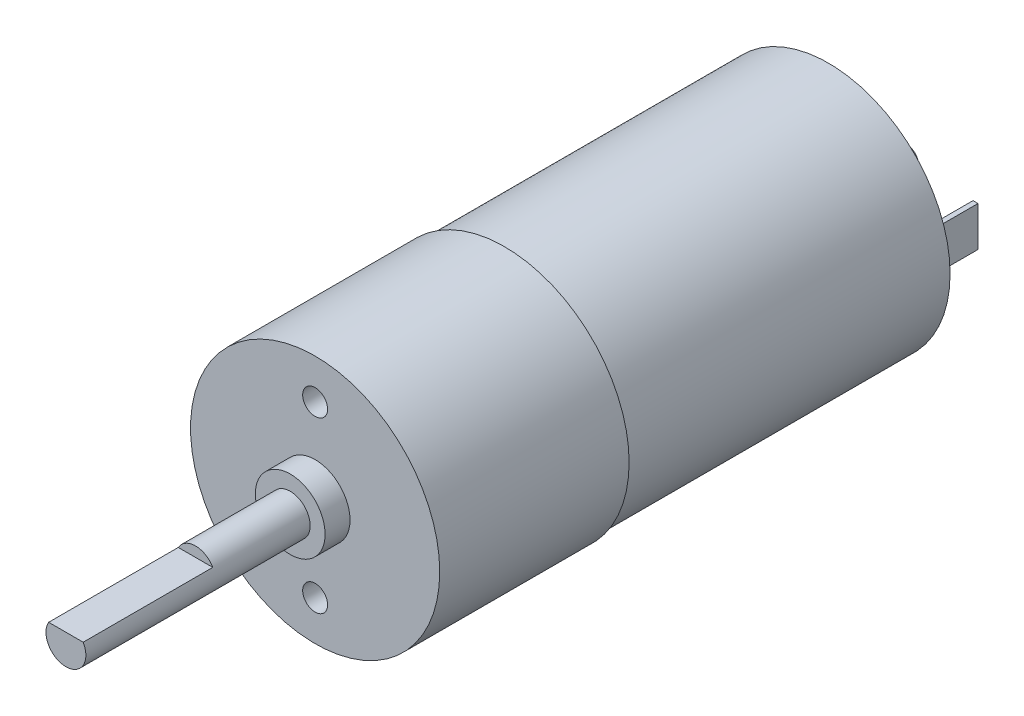
ISO-10303-21;
HEADER;
FILE_DESCRIPTION(('STEP AP214'),'2;1');
FILE_NAME('part.step','',(''),(''),'','','');
FILE_SCHEMA(('AUTOMOTIVE_DESIGN { 1 0 10303 214 1 1 1 1 }'));
ENDSEC;
DATA;
#1=APPLICATION_CONTEXT('core data for automotive mechanical design processes');
#2=APPLICATION_PROTOCOL_DEFINITION('international standard','automotive_design',2000,#1);
#3=PRODUCT_CONTEXT('',#1,'mechanical');
#4=PRODUCT('Part','Part','',(#3));
#5=PRODUCT_RELATED_PRODUCT_CATEGORY('part','',(#4));
#6=PRODUCT_DEFINITION_FORMATION('','',#4);
#7=PRODUCT_DEFINITION_CONTEXT('part definition',#1,'design');
#8=PRODUCT_DEFINITION('design','',#6,#7);
#9=PRODUCT_DEFINITION_SHAPE('','',#8);
#10=(LENGTH_UNIT() NAMED_UNIT(*) SI_UNIT(.MILLI.,.METRE.));
#11=(NAMED_UNIT(*) PLANE_ANGLE_UNIT() SI_UNIT($,.RADIAN.));
#12=(NAMED_UNIT(*) SI_UNIT($,.STERADIAN.) SOLID_ANGLE_UNIT());
#13=UNCERTAINTY_MEASURE_WITH_UNIT(LENGTH_MEASURE(1.E-05),#10,'distance_accuracy_value','');
#14=(GEOMETRIC_REPRESENTATION_CONTEXT(3) GLOBAL_UNCERTAINTY_ASSIGNED_CONTEXT((#13)) GLOBAL_UNIT_ASSIGNED_CONTEXT((#10,
#11,#12)) REPRESENTATION_CONTEXT('',''));
#15=CARTESIAN_POINT('',(0.,0.,0.));
#16=DIRECTION('',(0.,0.,1.));
#17=DIRECTION('',(1.,0.,0.));
#18=AXIS2_PLACEMENT_3D('',#15,#16,#17);
#19=CARTESIAN_POINT('',(0.,0.,-32.5));
#20=DIRECTION('',(0.,0.,-1.));
#21=DIRECTION('',(-1.,0.,0.));
#22=AXIS2_PLACEMENT_3D('',#19,#20,#21);
#23=PLANE('',#22);
#24=DIRECTION('',(1.,0.,0.));
#25=VECTOR('',#24,1.);
#26=CARTESIAN_POINT('',(9.,2.,-32.5));
#27=LINE('',#26,#25);
#28=CARTESIAN_POINT('',(9.,2.,-32.5));
#29=VERTEX_POINT('',#28);
#30=CARTESIAN_POINT('',(9.5,2.,-32.5));
#31=VERTEX_POINT('',#30);
#32=EDGE_CURVE('E139',#29,#31,#27,.T.);
#33=ORIENTED_EDGE('',*,*,#32,.F.);
#34=DIRECTION('',(0.,1.,0.));
#35=VECTOR('',#34,1.);
#36=CARTESIAN_POINT('',(9.,-2.,-32.5));
#37=LINE('',#36,#35);
#38=CARTESIAN_POINT('',(9.,-2.,-32.5));
#39=VERTEX_POINT('',#38);
#40=EDGE_CURVE('E136',#39,#29,#37,.T.);
#41=ORIENTED_EDGE('',*,*,#40,.F.);
#42=DIRECTION('',(-1.,0.,0.));
#43=VECTOR('',#42,1.);
#44=CARTESIAN_POINT('',(9.,-2.,-32.5));
#45=LINE('',#44,#43);
#46=CARTESIAN_POINT('',(9.5,-2.,-32.5));
#47=VERTEX_POINT('',#46);
#48=EDGE_CURVE('E148',#47,#39,#45,.T.);
#49=ORIENTED_EDGE('',*,*,#48,.F.);
#50=DIRECTION('',(0.,-1.,0.));
#51=VECTOR('',#50,1.);
#52=CARTESIAN_POINT('',(9.5,-2.,-32.5));
#53=LINE('',#52,#51);
#54=EDGE_CURVE('E156',#31,#47,#53,.T.);
#55=ORIENTED_EDGE('',*,*,#54,.F.);
#56=EDGE_LOOP('',(#33,#41,#49,#55));
#57=FACE_BOUND('',#56,.T.);
#58=CARTESIAN_POINT('',(0.,0.,-32.5));
#59=DIRECTION('',(0.,0.,-1.));
#60=DIRECTION('',(-1.,0.,0.));
#61=AXIS2_PLACEMENT_3D('',#58,#59,#60);
#62=CIRCLE('',#61,12.2);
#63=CARTESIAN_POINT('',(-12.2,0.,-32.5));
#64=VERTEX_POINT('',#63);
#65=EDGE_CURVE('E189',#64,#64,#62,.T.);
#66=ORIENTED_EDGE('',*,*,#65,.T.);
#67=EDGE_LOOP('',(#66));
#68=FACE_BOUND('',#67,.T.);
#69=CARTESIAN_POINT('',(0.,0.,-32.5));
#70=DIRECTION('',(0.,0.,-1.));
#71=DIRECTION('',(-1.,0.,0.));
#72=AXIS2_PLACEMENT_3D('',#69,#70,#71);
#73=CIRCLE('',#72,3.5);
#74=CARTESIAN_POINT('',(-3.5,0.,-32.5));
#75=VERTEX_POINT('',#74);
#76=EDGE_CURVE('E183',#75,#75,#73,.T.);
#77=ORIENTED_EDGE('',*,*,#76,.F.);
#78=EDGE_LOOP('',(#77));
#79=FACE_BOUND('',#78,.T.);
#80=DIRECTION('',(-1.,0.,0.));
#81=VECTOR('',#80,1.);
#82=CARTESIAN_POINT('',(-9.,-2.,-32.5));
#83=LINE('',#82,#81);
#84=CARTESIAN_POINT('',(-9.,-2.,-32.5));
#85=VERTEX_POINT('',#84);
#86=CARTESIAN_POINT('',(-9.5,-2.,-32.5));
#87=VERTEX_POINT('',#86);
#88=EDGE_CURVE('E532',#85,#87,#83,.T.);
#89=ORIENTED_EDGE('',*,*,#88,.F.);
#90=DIRECTION('',(0.,-1.,0.));
#91=VECTOR('',#90,1.);
#92=CARTESIAN_POINT('',(-9.,-2.,-32.5));
#93=LINE('',#92,#91);
#94=CARTESIAN_POINT('',(-9.,2.,-32.5));
#95=VERTEX_POINT('',#94);
#96=EDGE_CURVE('E134',#95,#85,#93,.T.);
#97=ORIENTED_EDGE('',*,*,#96,.F.);
#98=DIRECTION('',(1.,0.,0.));
#99=VECTOR('',#98,1.);
#100=CARTESIAN_POINT('',(-9.,2.,-32.5));
#101=LINE('',#100,#99);
#102=CARTESIAN_POINT('',(-9.5,2.,-32.5));
#103=VERTEX_POINT('',#102);
#104=EDGE_CURVE('E130',#103,#95,#101,.T.);
#105=ORIENTED_EDGE('',*,*,#104,.F.);
#106=DIRECTION('',(0.,1.,0.));
#107=VECTOR('',#106,1.);
#108=CARTESIAN_POINT('',(-9.5,-2.,-32.5));
#109=LINE('',#108,#107);
#110=EDGE_CURVE('E529',#87,#103,#109,.T.);
#111=ORIENTED_EDGE('',*,*,#110,.F.);
#112=EDGE_LOOP('',(#89,#97,#105,#111));
#113=FACE_BOUND('',#112,.T.);
#114=ADVANCED_FACE('F33',(#57,#68,#79,#113),#23,.T.);
#115=CARTESIAN_POINT('',(0.,0.,-35.5));
#116=DIRECTION('',(0.,0.,-1.));
#117=DIRECTION('',(-1.,0.,0.));
#118=AXIS2_PLACEMENT_3D('',#115,#116,#117);
#119=PLANE('',#118);
#120=CARTESIAN_POINT('',(0.,0.,-35.5));
#121=DIRECTION('',(0.,0.,-1.));
#122=DIRECTION('',(-1.,0.,0.));
#123=AXIS2_PLACEMENT_3D('',#120,#121,#122);
#124=CIRCLE('',#123,3.5);
#125=CARTESIAN_POINT('',(-3.5,0.,-35.5));
#126=VERTEX_POINT('',#125);
#127=EDGE_CURVE('E186',#126,#126,#124,.T.);
#128=ORIENTED_EDGE('',*,*,#127,.T.);
#129=EDGE_LOOP('',(#128));
#130=FACE_BOUND('',#129,.T.);
#131=CARTESIAN_POINT('',(0.,0.,-35.5));
#132=DIRECTION('',(0.,0.,-1.));
#133=DIRECTION('',(-1.,0.,0.));
#134=AXIS2_PLACEMENT_3D('',#131,#132,#133);
#135=CIRCLE('',#134,1.);
#136=CARTESIAN_POINT('',(-1.,0.,-35.5));
#137=VERTEX_POINT('',#136);
#138=EDGE_CURVE('E177',#137,#137,#135,.T.);
#139=ORIENTED_EDGE('',*,*,#138,.F.);
#140=EDGE_LOOP('',(#139));
#141=FACE_BOUND('',#140,.T.);
#142=ADVANCED_FACE('F246',(#130,#141),#119,.T.);
#143=CARTESIAN_POINT('',(0.,0.,0.));
#144=DIRECTION('',(0.,0.,1.));
#145=DIRECTION('',(1.,0.,0.));
#146=AXIS2_PLACEMENT_3D('',#143,#144,#145);
#147=PLANE('',#146);
#148=CARTESIAN_POINT('',(0.,0.,0.));
#149=DIRECTION('',(0.,0.,1.));
#150=DIRECTION('',(1.,0.,0.));
#151=AXIS2_PLACEMENT_3D('',#148,#149,#150);
#152=CIRCLE('',#151,12.5);
#153=CARTESIAN_POINT('',(12.5,0.,0.));
#154=VERTEX_POINT('',#153);
#155=EDGE_CURVE('E213',#154,#154,#152,.T.);
#156=ORIENTED_EDGE('',*,*,#155,.F.);
#157=EDGE_LOOP('',(#156));
#158=FACE_BOUND('',#157,.T.);
#159=CARTESIAN_POINT('',(0.,0.,0.));
#160=DIRECTION('',(0.,0.,1.));
#161=DIRECTION('',(1.,0.,0.));
#162=AXIS2_PLACEMENT_3D('',#159,#160,#161);
#163=CIRCLE('',#162,12.2);
#164=CARTESIAN_POINT('',(12.2,0.,0.));
#165=VERTEX_POINT('',#164);
#166=EDGE_CURVE('E11',#165,#165,#163,.F.);
#167=ORIENTED_EDGE('',*,*,#166,.F.);
#168=EDGE_LOOP('',(#167));
#169=FACE_BOUND('',#168,.T.);
#170=ADVANCED_FACE('F252',(#158,#169),#147,.F.);
#171=CARTESIAN_POINT('',(0.,0.,21.5));
#172=DIRECTION('',(0.,0.,1.));
#173=DIRECTION('',(1.,0.,0.));
#174=AXIS2_PLACEMENT_3D('',#171,#172,#173);
#175=PLANE('',#174);
#176=CARTESIAN_POINT('',(0.,0.,21.5));
#177=DIRECTION('',(0.,0.,1.));
#178=DIRECTION('',(1.,0.,0.));
#179=AXIS2_PLACEMENT_3D('',#176,#177,#178);
#180=CIRCLE('',#179,3.5);
#181=CARTESIAN_POINT('',(3.5,0.,21.5));
#182=VERTEX_POINT('',#181);
#183=EDGE_CURVE('E210',#182,#182,#180,.T.);
#184=ORIENTED_EDGE('',*,*,#183,.T.);
#185=EDGE_LOOP('',(#184));
#186=FACE_BOUND('',#185,.T.);
#187=CARTESIAN_POINT('',(0.,0.,21.5));
#188=DIRECTION('',(0.,0.,1.));
#189=DIRECTION('',(1.,0.,0.));
#190=AXIS2_PLACEMENT_3D('',#187,#188,#189);
#191=CIRCLE('',#190,2.);
#192=CARTESIAN_POINT('',(2.,0.,21.5));
#193=VERTEX_POINT('',#192);
#194=EDGE_CURVE('E203',#193,#193,#191,.T.);
#195=ORIENTED_EDGE('',*,*,#194,.F.);
#196=EDGE_LOOP('',(#195));
#197=FACE_BOUND('',#196,.T.);
#198=ADVANCED_FACE('F451',(#186,#197),#175,.T.);
#199=CARTESIAN_POINT('',(0.,0.,19.));
#200=DIRECTION('',(0.,0.,1.));
#201=DIRECTION('',(1.,0.,0.));
#202=AXIS2_PLACEMENT_3D('',#199,#200,#201);
#203=PLANE('',#202);
#204=CARTESIAN_POINT('',(0.,-8.5,19.));
#205=DIRECTION('',(0.,0.,1.));
#206=DIRECTION('',(1.,0.,0.));
#207=AXIS2_PLACEMENT_3D('',#204,#205,#206);
#208=CIRCLE('',#207,1.25);
#209=CARTESIAN_POINT('',(1.25,-8.5,19.));
#210=VERTEX_POINT('',#209);
#211=EDGE_CURVE('E167',#210,#210,#208,.T.);
#212=ORIENTED_EDGE('',*,*,#211,.F.);
#213=EDGE_LOOP('',(#212));
#214=FACE_BOUND('',#213,.T.);
#215=CARTESIAN_POINT('',(0.,8.5,19.));
#216=DIRECTION('',(0.,0.,1.));
#217=DIRECTION('',(1.,0.,0.));
#218=AXIS2_PLACEMENT_3D('',#215,#216,#217);
#219=CIRCLE('',#218,1.25);
#220=CARTESIAN_POINT('',(1.25,8.5,19.));
#221=VERTEX_POINT('',#220);
#222=EDGE_CURVE('E171',#221,#221,#219,.T.);
#223=ORIENTED_EDGE('',*,*,#222,.F.);
#224=EDGE_LOOP('',(#223));
#225=FACE_BOUND('',#224,.T.);
#226=CARTESIAN_POINT('',(0.,0.,19.));
#227=DIRECTION('',(0.,0.,1.));
#228=DIRECTION('',(1.,0.,0.));
#229=AXIS2_PLACEMENT_3D('',#226,#227,#228);
#230=CIRCLE('',#229,12.5);
#231=CARTESIAN_POINT('',(12.5,0.,19.));
#232=VERTEX_POINT('',#231);
#233=EDGE_CURVE('E216',#232,#232,#230,.T.);
#234=ORIENTED_EDGE('',*,*,#233,.T.);
#235=EDGE_LOOP('',(#234));
#236=FACE_BOUND('',#235,.T.);
#237=CARTESIAN_POINT('',(0.,0.,19.));
#238=DIRECTION('',(0.,0.,1.));
#239=DIRECTION('',(1.,0.,0.));
#240=AXIS2_PLACEMENT_3D('',#237,#238,#239);
#241=CIRCLE('',#240,3.5);
#242=CARTESIAN_POINT('',(3.5,0.,19.));
#243=VERTEX_POINT('',#242);
#244=EDGE_CURVE('E207',#243,#243,#241,.T.);
#245=ORIENTED_EDGE('',*,*,#244,.F.);
#246=EDGE_LOOP('',(#245));
#247=FACE_BOUND('',#246,.T.);
#248=ADVANCED_FACE('F475',(#214,#225,#236,#247),#203,.T.);
#249=CARTESIAN_POINT('',(0.,0.,19.));
#250=DIRECTION('',(0.,0.,-1.));
#251=DIRECTION('',(-1.,0.,0.));
#252=AXIS2_PLACEMENT_3D('',#249,#250,#251);
#253=CYLINDRICAL_SURFACE('',#252,12.5);
#254=ORIENTED_EDGE('',*,*,#233,.F.);
#255=EDGE_LOOP('',(#254));
#256=FACE_BOUND('',#255,.T.);
#257=ORIENTED_EDGE('',*,*,#155,.T.);
#258=EDGE_LOOP('',(#257));
#259=FACE_BOUND('',#258,.T.);
#260=ADVANCED_FACE('F35',(#256,#259),#253,.T.);
#261=CARTESIAN_POINT('',(0.,0.,21.5));
#262=DIRECTION('',(0.,0.,-1.));
#263=DIRECTION('',(-1.,0.,0.));
#264=AXIS2_PLACEMENT_3D('',#261,#262,#263);
#265=CYLINDRICAL_SURFACE('',#264,3.5);
#266=ORIENTED_EDGE('',*,*,#183,.F.);
#267=EDGE_LOOP('',(#266));
#268=FACE_BOUND('',#267,.T.);
#269=ORIENTED_EDGE('',*,*,#244,.T.);
#270=EDGE_LOOP('',(#269));
#271=FACE_BOUND('',#270,.T.);
#272=ADVANCED_FACE('F242',(#268,#271),#265,.T.);
#273=CARTESIAN_POINT('',(0.,0.,44.));
#274=DIRECTION('',(0.,0.,-1.));
#275=DIRECTION('',(-1.,0.,0.));
#276=AXIS2_PLACEMENT_3D('',#273,#274,#275);
#277=CYLINDRICAL_SURFACE('',#276,2.);
#278=CARTESIAN_POINT('',(0.,0.,44.));
#279=DIRECTION('',(0.,0.,1.));
#280=DIRECTION('',(1.,0.,0.));
#281=AXIS2_PLACEMENT_3D('',#278,#279,#280);
#282=CIRCLE('',#281,2.);
#283=CARTESIAN_POINT('',(-1.73205080756888,1.,44.));
#284=VERTEX_POINT('',#283);
#285=CARTESIAN_POINT('',(1.73205080756888,1.,44.));
#286=VERTEX_POINT('',#285);
#287=EDGE_CURVE('E204',#284,#286,#282,.T.);
#288=ORIENTED_EDGE('',*,*,#287,.F.);
#289=DIRECTION('',(0.,0.,-1.));
#290=VECTOR('',#289,1.);
#291=CARTESIAN_POINT('',(-1.73205080756888,1.,44.));
#292=LINE('',#291,#290);
#293=CARTESIAN_POINT('',(-1.73205080756888,1.,31.));
#294=VERTEX_POINT('',#293);
#295=EDGE_CURVE('E200',#284,#294,#292,.T.);
#296=ORIENTED_EDGE('',*,*,#295,.T.);
#297=CARTESIAN_POINT('',(0.,0.,31.));
#298=DIRECTION('',(0.,0.,1.));
#299=DIRECTION('',(1.,0.,0.));
#300=AXIS2_PLACEMENT_3D('',#297,#298,#299);
#301=CIRCLE('',#300,2.);
#302=CARTESIAN_POINT('',(1.73205080756888,1.,31.));
#303=VERTEX_POINT('',#302);
#304=EDGE_CURVE('E41',#303,#294,#301,.T.);
#305=ORIENTED_EDGE('',*,*,#304,.F.);
#306=DIRECTION('',(0.,0.,-1.));
#307=VECTOR('',#306,1.);
#308=CARTESIAN_POINT('',(1.73205080756888,1.,44.));
#309=LINE('',#308,#307);
#310=EDGE_CURVE('E197',#303,#286,#309,.F.);
#311=ORIENTED_EDGE('',*,*,#310,.T.);
#312=EDGE_LOOP('',(#288,#296,#305,#311));
#313=FACE_BOUND('',#312,.T.);
#314=ORIENTED_EDGE('',*,*,#194,.T.);
#315=EDGE_LOOP('',(#314));
#316=FACE_BOUND('',#315,.T.);
#317=ADVANCED_FACE('F231',(#313,#316),#277,.T.);
#318=CARTESIAN_POINT('',(0.,0.,44.));
#319=DIRECTION('',(0.,0.,1.));
#320=DIRECTION('',(1.,0.,0.));
#321=AXIS2_PLACEMENT_3D('',#318,#319,#320);
#322=PLANE('',#321);
#323=DIRECTION('',(1.,0.,0.));
#324=VECTOR('',#323,1.);
#325=CARTESIAN_POINT('',(0.,1.,44.));
#326=LINE('',#325,#324);
#327=EDGE_CURVE('E219',#284,#286,#326,.T.);
#328=ORIENTED_EDGE('',*,*,#327,.F.);
#329=ORIENTED_EDGE('',*,*,#287,.T.);
#330=EDGE_LOOP('',(#328,#329));
#331=FACE_BOUND('',#330,.T.);
#332=ADVANCED_FACE('F234',(#331),#322,.T.);
#333=CARTESIAN_POINT('',(0.,0.,31.));
#334=DIRECTION('',(0.,0.,1.));
#335=DIRECTION('',(1.,0.,0.));
#336=AXIS2_PLACEMENT_3D('',#333,#334,#335);
#337=PLANE('',#336);
#338=ORIENTED_EDGE('',*,*,#304,.T.);
#339=DIRECTION('',(1.,0.,0.));
#340=VECTOR('',#339,1.);
#341=CARTESIAN_POINT('',(3.32973487593335,1.,31.));
#342=LINE('',#341,#340);
#343=EDGE_CURVE('E194',#294,#303,#342,.T.);
#344=ORIENTED_EDGE('',*,*,#343,.T.);
#345=EDGE_LOOP('',(#338,#344));
#346=FACE_BOUND('',#345,.T.);
#347=ADVANCED_FACE('F225',(#346),#337,.T.);
#348=CARTESIAN_POINT('',(3.32973487593335,1.,31.));
#349=DIRECTION('',(0.,-1.,0.));
#350=DIRECTION('',(0.,0.,-1.));
#351=AXIS2_PLACEMENT_3D('',#348,#349,#350);
#352=PLANE('',#351);
#353=ORIENTED_EDGE('',*,*,#327,.T.);
#354=ORIENTED_EDGE('',*,*,#310,.F.);
#355=ORIENTED_EDGE('',*,*,#343,.F.);
#356=ORIENTED_EDGE('',*,*,#295,.F.);
#357=EDGE_LOOP('',(#353,#354,#355,#356));
#358=FACE_BOUND('',#357,.T.);
#359=ADVANCED_FACE('F228',(#358),#352,.F.);
#360=CARTESIAN_POINT('',(0.,0.,-32.5));
#361=DIRECTION('',(0.,0.,1.));
#362=DIRECTION('',(1.,0.,0.));
#363=AXIS2_PLACEMENT_3D('',#360,#361,#362);
#364=CYLINDRICAL_SURFACE('',#363,12.2);
#365=ORIENTED_EDGE('',*,*,#65,.F.);
#366=EDGE_LOOP('',(#365));
#367=FACE_BOUND('',#366,.T.);
#368=ORIENTED_EDGE('',*,*,#166,.T.);
#369=EDGE_LOOP('',(#368));
#370=FACE_BOUND('',#369,.T.);
#371=ADVANCED_FACE('F260',(#367,#370),#364,.T.);
#372=CARTESIAN_POINT('',(0.,0.,-35.5));
#373=DIRECTION('',(0.,0.,1.));
#374=DIRECTION('',(1.,0.,0.));
#375=AXIS2_PLACEMENT_3D('',#372,#373,#374);
#376=CYLINDRICAL_SURFACE('',#375,3.5);
#377=ORIENTED_EDGE('',*,*,#127,.F.);
#378=EDGE_LOOP('',(#377));
#379=FACE_BOUND('',#378,.T.);
#380=ORIENTED_EDGE('',*,*,#76,.T.);
#381=EDGE_LOOP('',(#380));
#382=FACE_BOUND('',#381,.T.);
#383=ADVANCED_FACE('F259',(#379,#382),#376,.T.);
#384=CARTESIAN_POINT('',(0.,0.,-40.5));
#385=DIRECTION('',(0.,0.,1.));
#386=DIRECTION('',(1.,0.,0.));
#387=AXIS2_PLACEMENT_3D('',#384,#385,#386);
#388=CYLINDRICAL_SURFACE('',#387,1.);
#389=CARTESIAN_POINT('',(0.,0.,-40.5));
#390=DIRECTION('',(0.,0.,-1.));
#391=DIRECTION('',(-1.,0.,0.));
#392=AXIS2_PLACEMENT_3D('',#389,#390,#391);
#393=CIRCLE('',#392,1.);
#394=CARTESIAN_POINT('',(-1.,0.,-40.5));
#395=VERTEX_POINT('',#394);
#396=EDGE_CURVE('E180',#395,#395,#393,.T.);
#397=ORIENTED_EDGE('',*,*,#396,.F.);
#398=EDGE_LOOP('',(#397));
#399=FACE_BOUND('',#398,.T.);
#400=ORIENTED_EDGE('',*,*,#138,.T.);
#401=EDGE_LOOP('',(#400));
#402=FACE_BOUND('',#401,.T.);
#403=ADVANCED_FACE('F279',(#399,#402),#388,.T.);
#404=CARTESIAN_POINT('',(0.,0.,-40.5));
#405=DIRECTION('',(0.,0.,-1.));
#406=DIRECTION('',(-1.,0.,0.));
#407=AXIS2_PLACEMENT_3D('',#404,#405,#406);
#408=PLANE('',#407);
#409=ORIENTED_EDGE('',*,*,#396,.T.);
#410=EDGE_LOOP('',(#409));
#411=FACE_BOUND('',#410,.T.);
#412=ADVANCED_FACE('F287',(#411),#408,.T.);
#413=CARTESIAN_POINT('',(0.,8.5,14.));
#414=DIRECTION('',(0.,0.,1.));
#415=DIRECTION('',(1.,0.,0.));
#416=AXIS2_PLACEMENT_3D('',#413,#414,#415);
#417=CYLINDRICAL_SURFACE('',#416,1.25);
#418=CARTESIAN_POINT('',(0.,8.5,14.));
#419=DIRECTION('',(0.,0.,1.));
#420=DIRECTION('',(1.,0.,0.));
#421=AXIS2_PLACEMENT_3D('',#418,#419,#420);
#422=CIRCLE('',#421,1.25);
#423=CARTESIAN_POINT('',(1.25,8.5,14.));
#424=VERTEX_POINT('',#423);
#425=EDGE_CURVE('E174',#424,#424,#422,.T.);
#426=ORIENTED_EDGE('',*,*,#425,.F.);
#427=EDGE_LOOP('',(#426));
#428=FACE_BOUND('',#427,.T.);
#429=ORIENTED_EDGE('',*,*,#222,.T.);
#430=EDGE_LOOP('',(#429));
#431=FACE_BOUND('',#430,.T.);
#432=ADVANCED_FACE('F295',(#428,#431),#417,.F.);
#433=CARTESIAN_POINT('',(0.,8.5,14.));
#434=DIRECTION('',(0.,0.,1.));
#435=DIRECTION('',(1.,0.,0.));
#436=AXIS2_PLACEMENT_3D('',#433,#434,#435);
#437=PLANE('',#436);
#438=ORIENTED_EDGE('',*,*,#425,.T.);
#439=EDGE_LOOP('',(#438));
#440=FACE_BOUND('',#439,.T.);
#441=ADVANCED_FACE('F304',(#440),#437,.T.);
#442=CARTESIAN_POINT('',(0.,-8.5,14.));
#443=DIRECTION('',(0.,0.,1.));
#444=DIRECTION('',(1.,0.,0.));
#445=AXIS2_PLACEMENT_3D('',#442,#443,#444);
#446=CYLINDRICAL_SURFACE('',#445,1.25);
#447=CARTESIAN_POINT('',(0.,-8.5,14.));
#448=DIRECTION('',(0.,0.,1.));
#449=DIRECTION('',(1.,0.,0.));
#450=AXIS2_PLACEMENT_3D('',#447,#448,#449);
#451=CIRCLE('',#450,1.25);
#452=CARTESIAN_POINT('',(1.25,-8.5,14.));
#453=VERTEX_POINT('',#452);
#454=EDGE_CURVE('E168',#453,#453,#451,.T.);
#455=ORIENTED_EDGE('',*,*,#454,.F.);
#456=EDGE_LOOP('',(#455));
#457=FACE_BOUND('',#456,.T.);
#458=ORIENTED_EDGE('',*,*,#211,.T.);
#459=EDGE_LOOP('',(#458));
#460=FACE_BOUND('',#459,.T.);
#461=ADVANCED_FACE('F312',(#457,#460),#446,.F.);
#462=CARTESIAN_POINT('',(0.,-8.5,14.));
#463=DIRECTION('',(0.,0.,1.));
#464=DIRECTION('',(1.,0.,0.));
#465=AXIS2_PLACEMENT_3D('',#462,#463,#464);
#466=PLANE('',#465);
#467=ORIENTED_EDGE('',*,*,#454,.T.);
#468=EDGE_LOOP('',(#467));
#469=FACE_BOUND('',#468,.T.);
#470=ADVANCED_FACE('F320',(#469),#466,.T.);
#471=CARTESIAN_POINT('',(9.,-2.,-38.));
#472=DIRECTION('',(1.,0.,0.));
#473=DIRECTION('',(0.,0.,-1.));
#474=AXIS2_PLACEMENT_3D('',#471,#472,#473);
#475=PLANE('',#474);
#476=ORIENTED_EDGE('',*,*,#40,.T.);
#477=DIRECTION('',(0.,0.,1.));
#478=VECTOR('',#477,1.);
#479=CARTESIAN_POINT('',(9.,2.,-38.));
#480=LINE('',#479,#478);
#481=CARTESIAN_POINT('',(9.,2.,-38.));
#482=VERTEX_POINT('',#481);
#483=EDGE_CURVE('E165',#482,#29,#480,.T.);
#484=ORIENTED_EDGE('',*,*,#483,.F.);
#485=DIRECTION('',(0.,1.,0.));
#486=VECTOR('',#485,1.);
#487=CARTESIAN_POINT('',(9.,-2.,-38.));
#488=LINE('',#487,#486);
#489=CARTESIAN_POINT('',(9.,-2.,-38.));
#490=VERTEX_POINT('',#489);
#491=EDGE_CURVE('E144',#490,#482,#488,.T.);
#492=ORIENTED_EDGE('',*,*,#491,.F.);
#493=DIRECTION('',(0.,0.,1.));
#494=VECTOR('',#493,1.);
#495=CARTESIAN_POINT('',(9.,-2.,-38.));
#496=LINE('',#495,#494);
#497=EDGE_CURVE('E153',#490,#39,#496,.T.);
#498=ORIENTED_EDGE('',*,*,#497,.T.);
#499=EDGE_LOOP('',(#476,#484,#492,#498));
#500=FACE_BOUND('',#499,.T.);
#501=ADVANCED_FACE('F328',(#500),#475,.F.);
#502=CARTESIAN_POINT('',(9.,2.,-38.));
#503=DIRECTION('',(0.,-1.,0.));
#504=DIRECTION('',(0.,0.,-1.));
#505=AXIS2_PLACEMENT_3D('',#502,#503,#504);
#506=PLANE('',#505);
#507=ORIENTED_EDGE('',*,*,#32,.T.);
#508=DIRECTION('',(0.,0.,1.));
#509=VECTOR('',#508,1.);
#510=CARTESIAN_POINT('',(9.5,2.,-38.));
#511=LINE('',#510,#509);
#512=CARTESIAN_POINT('',(9.5,2.,-38.));
#513=VERTEX_POINT('',#512);
#514=EDGE_CURVE('E162',#513,#31,#511,.T.);
#515=ORIENTED_EDGE('',*,*,#514,.F.);
#516=DIRECTION('',(1.,0.,0.));
#517=VECTOR('',#516,1.);
#518=CARTESIAN_POINT('',(9.,2.,-38.));
#519=LINE('',#518,#517);
#520=EDGE_CURVE('E147',#482,#513,#519,.T.);
#521=ORIENTED_EDGE('',*,*,#520,.F.);
#522=ORIENTED_EDGE('',*,*,#483,.T.);
#523=EDGE_LOOP('',(#507,#515,#521,#522));
#524=FACE_BOUND('',#523,.T.);
#525=ADVANCED_FACE('F336',(#524),#506,.F.);
#526=CARTESIAN_POINT('',(9.5,-2.,-38.));
#527=DIRECTION('',(-1.,0.,0.));
#528=DIRECTION('',(0.,0.,1.));
#529=AXIS2_PLACEMENT_3D('',#526,#527,#528);
#530=PLANE('',#529);
#531=ORIENTED_EDGE('',*,*,#54,.T.);
#532=DIRECTION('',(0.,0.,1.));
#533=VECTOR('',#532,1.);
#534=CARTESIAN_POINT('',(9.5,-2.,-38.));
#535=LINE('',#534,#533);
#536=CARTESIAN_POINT('',(9.5,-2.,-38.));
#537=VERTEX_POINT('',#536);
#538=EDGE_CURVE('E56',#537,#47,#535,.T.);
#539=ORIENTED_EDGE('',*,*,#538,.F.);
#540=DIRECTION('',(0.,-1.,0.));
#541=VECTOR('',#540,1.);
#542=CARTESIAN_POINT('',(9.5,-2.,-38.));
#543=LINE('',#542,#541);
#544=EDGE_CURVE('E150',#513,#537,#543,.T.);
#545=ORIENTED_EDGE('',*,*,#544,.F.);
#546=ORIENTED_EDGE('',*,*,#514,.T.);
#547=EDGE_LOOP('',(#531,#539,#545,#546));
#548=FACE_BOUND('',#547,.T.);
#549=ADVANCED_FACE('F344',(#548),#530,.F.);
#550=CARTESIAN_POINT('',(9.,-2.,-38.));
#551=DIRECTION('',(0.,1.,0.));
#552=DIRECTION('',(0.,0.,1.));
#553=AXIS2_PLACEMENT_3D('',#550,#551,#552);
#554=PLANE('',#553);
#555=ORIENTED_EDGE('',*,*,#48,.T.);
#556=ORIENTED_EDGE('',*,*,#497,.F.);
#557=DIRECTION('',(-1.,0.,0.));
#558=VECTOR('',#557,1.);
#559=CARTESIAN_POINT('',(9.,-2.,-38.));
#560=LINE('',#559,#558);
#561=EDGE_CURVE('E152',#537,#490,#560,.T.);
#562=ORIENTED_EDGE('',*,*,#561,.F.);
#563=ORIENTED_EDGE('',*,*,#538,.T.);
#564=EDGE_LOOP('',(#555,#556,#562,#563));
#565=FACE_BOUND('',#564,.T.);
#566=ADVANCED_FACE('F352',(#565),#554,.F.);
#567=CARTESIAN_POINT('',(0.,0.,-38.));
#568=DIRECTION('',(0.,0.,-1.));
#569=DIRECTION('',(-1.,0.,0.));
#570=AXIS2_PLACEMENT_3D('',#567,#568,#569);
#571=PLANE('',#570);
#572=ORIENTED_EDGE('',*,*,#491,.T.);
#573=ORIENTED_EDGE('',*,*,#520,.T.);
#574=ORIENTED_EDGE('',*,*,#544,.T.);
#575=ORIENTED_EDGE('',*,*,#561,.T.);
#576=EDGE_LOOP('',(#572,#573,#574,#575));
#577=FACE_BOUND('',#576,.T.);
#578=ADVANCED_FACE('F360',(#577),#571,.T.);
#579=CARTESIAN_POINT('',(-9.,-2.,-38.));
#580=DIRECTION('',(-1.,0.,0.));
#581=DIRECTION('',(0.,0.,1.));
#582=AXIS2_PLACEMENT_3D('',#579,#580,#581);
#583=PLANE('',#582);
#584=ORIENTED_EDGE('',*,*,#96,.T.);
#585=DIRECTION('',(0.,0.,1.));
#586=VECTOR('',#585,1.);
#587=CARTESIAN_POINT('',(-9.,-2.,-38.));
#588=LINE('',#587,#586);
#589=CARTESIAN_POINT('',(-9.,-2.,-38.));
#590=VERTEX_POINT('',#589);
#591=EDGE_CURVE('E115',#590,#85,#588,.T.);
#592=ORIENTED_EDGE('',*,*,#591,.F.);
#593=DIRECTION('',(0.,-1.,0.));
#594=VECTOR('',#593,1.);
#595=CARTESIAN_POINT('',(-9.,-2.,-38.));
#596=LINE('',#595,#594);
#597=CARTESIAN_POINT('',(-9.,2.,-38.));
#598=VERTEX_POINT('',#597);
#599=EDGE_CURVE('E122',#598,#590,#596,.T.);
#600=ORIENTED_EDGE('',*,*,#599,.F.);
#601=DIRECTION('',(0.,0.,1.));
#602=VECTOR('',#601,1.);
#603=CARTESIAN_POINT('',(-9.,2.,-38.));
#604=LINE('',#603,#602);
#605=EDGE_CURVE('E526',#598,#95,#604,.T.);
#606=ORIENTED_EDGE('',*,*,#605,.T.);
#607=EDGE_LOOP('',(#584,#592,#600,#606));
#608=FACE_BOUND('',#607,.T.);
#609=ADVANCED_FACE('F132',(#608),#583,.F.);
#610=CARTESIAN_POINT('',(-9.,-2.,-38.));
#611=DIRECTION('',(0.,1.,0.));
#612=DIRECTION('',(0.,0.,1.));
#613=AXIS2_PLACEMENT_3D('',#610,#611,#612);
#614=PLANE('',#613);
#615=ORIENTED_EDGE('',*,*,#88,.T.);
#616=DIRECTION('',(0.,0.,1.));
#617=VECTOR('',#616,1.);
#618=CARTESIAN_POINT('',(-9.5,-2.,-38.));
#619=LINE('',#618,#617);
#620=CARTESIAN_POINT('',(-9.5,-2.,-38.));
#621=VERTEX_POINT('',#620);
#622=EDGE_CURVE('E118',#621,#87,#619,.T.);
#623=ORIENTED_EDGE('',*,*,#622,.F.);
#624=DIRECTION('',(-1.,0.,0.));
#625=VECTOR('',#624,1.);
#626=CARTESIAN_POINT('',(-9.,-2.,-38.));
#627=LINE('',#626,#625);
#628=EDGE_CURVE('E111',#590,#621,#627,.T.);
#629=ORIENTED_EDGE('',*,*,#628,.F.);
#630=ORIENTED_EDGE('',*,*,#591,.T.);
#631=EDGE_LOOP('',(#615,#623,#629,#630));
#632=FACE_BOUND('',#631,.T.);
#633=ADVANCED_FACE('F113',(#632),#614,.F.);
#634=CARTESIAN_POINT('',(-9.5,-2.,-38.));
#635=DIRECTION('',(1.,0.,0.));
#636=DIRECTION('',(0.,0.,-1.));
#637=AXIS2_PLACEMENT_3D('',#634,#635,#636);
#638=PLANE('',#637);
#639=ORIENTED_EDGE('',*,*,#110,.T.);
#640=DIRECTION('',(0.,0.,1.));
#641=VECTOR('',#640,1.);
#642=CARTESIAN_POINT('',(-9.5,2.,-38.));
#643=LINE('',#642,#641);
#644=CARTESIAN_POINT('',(-9.5,2.,-38.));
#645=VERTEX_POINT('',#644);
#646=EDGE_CURVE('E48',#645,#103,#643,.T.);
#647=ORIENTED_EDGE('',*,*,#646,.F.);
#648=DIRECTION('',(0.,1.,0.));
#649=VECTOR('',#648,1.);
#650=CARTESIAN_POINT('',(-9.5,-2.,-38.));
#651=LINE('',#650,#649);
#652=EDGE_CURVE('E121',#621,#645,#651,.T.);
#653=ORIENTED_EDGE('',*,*,#652,.F.);
#654=ORIENTED_EDGE('',*,*,#622,.T.);
#655=EDGE_LOOP('',(#639,#647,#653,#654));
#656=FACE_BOUND('',#655,.T.);
#657=ADVANCED_FACE('F380',(#656),#638,.F.);
#658=CARTESIAN_POINT('',(-9.,2.,-38.));
#659=DIRECTION('',(0.,-1.,0.));
#660=DIRECTION('',(1.,0.,0.));
#661=AXIS2_PLACEMENT_3D('',#658,#659,#660);
#662=PLANE('',#661);
#663=ORIENTED_EDGE('',*,*,#104,.T.);
#664=ORIENTED_EDGE('',*,*,#605,.F.);
#665=DIRECTION('',(1.,0.,0.));
#666=VECTOR('',#665,1.);
#667=CARTESIAN_POINT('',(-9.,2.,-38.));
#668=LINE('',#667,#666);
#669=EDGE_CURVE('E126',#645,#598,#668,.T.);
#670=ORIENTED_EDGE('',*,*,#669,.F.);
#671=ORIENTED_EDGE('',*,*,#646,.T.);
#672=EDGE_LOOP('',(#663,#664,#670,#671));
#673=FACE_BOUND('',#672,.T.);
#674=ADVANCED_FACE('F387',(#673),#662,.F.);
#675=CARTESIAN_POINT('',(0.,0.,-38.));
#676=DIRECTION('',(0.,0.,1.));
#677=DIRECTION('',(1.,0.,0.));
#678=AXIS2_PLACEMENT_3D('',#675,#676,#677);
#679=PLANE('',#678);
#680=ORIENTED_EDGE('',*,*,#599,.T.);
#681=ORIENTED_EDGE('',*,*,#628,.T.);
#682=ORIENTED_EDGE('',*,*,#652,.T.);
#683=ORIENTED_EDGE('',*,*,#669,.T.);
#684=EDGE_LOOP('',(#680,#681,#682,#683));
#685=FACE_BOUND('',#684,.T.);
#686=ADVANCED_FACE('F125',(#685),#679,.F.);
#687=CLOSED_SHELL('',(#114,#142,#170,#198,#248,#260,#272,#317,#332,#347,#359,#371,#383,#403,
#412,#432,#441,#461,#470,#501,#525,#549,#566,#578,#609,#633,#657,#674,#686));
#688=MANIFOLD_SOLID_BREP('B2',#687);
#689=ADVANCED_BREP_SHAPE_REPRESENTATION('',(#18,#688),#14);
#690=SHAPE_DEFINITION_REPRESENTATION(#9,#689);
ENDSEC;
END-ISO-10303-21;
